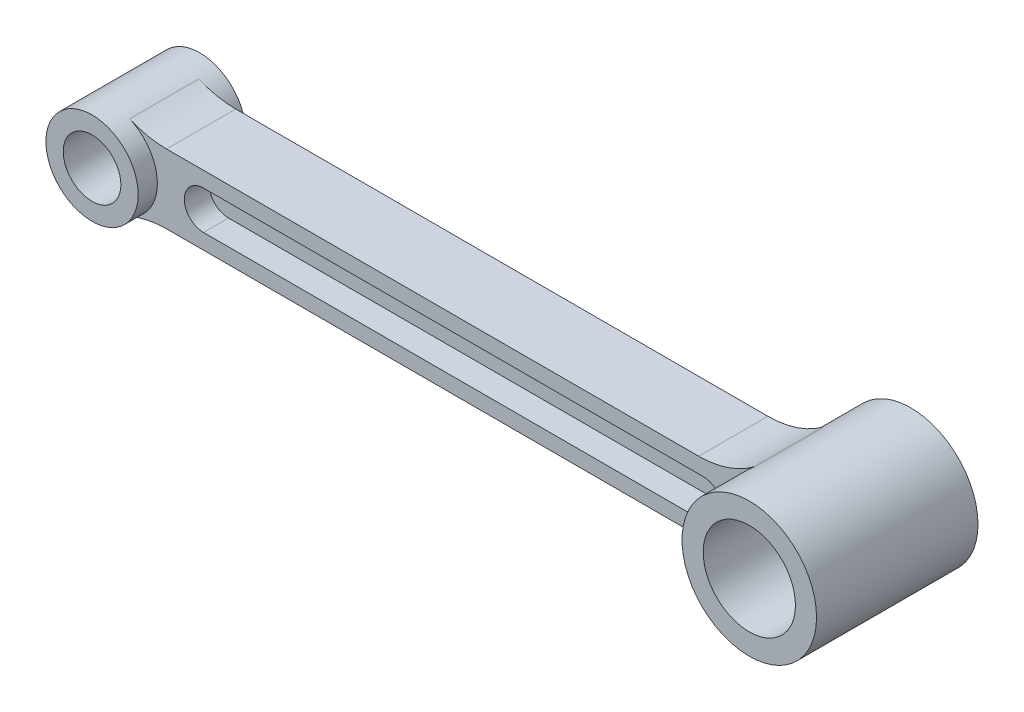
ISO-10303-21;
HEADER;
FILE_DESCRIPTION(('STEP AP214'),'2;1');
FILE_NAME('part.step','',(''),(''),'','','');
FILE_SCHEMA(('AUTOMOTIVE_DESIGN { 1 0 10303 214 1 1 1 1 }'));
ENDSEC;
DATA;
#1=APPLICATION_CONTEXT('core data for automotive mechanical design processes');
#2=APPLICATION_PROTOCOL_DEFINITION('international standard','automotive_design',2000,#1);
#3=PRODUCT_CONTEXT('',#1,'mechanical');
#4=PRODUCT('Part','Part','',(#3));
#5=PRODUCT_RELATED_PRODUCT_CATEGORY('part','',(#4));
#6=PRODUCT_DEFINITION_FORMATION('','',#4);
#7=PRODUCT_DEFINITION_CONTEXT('part definition',#1,'design');
#8=PRODUCT_DEFINITION('design','',#6,#7);
#9=PRODUCT_DEFINITION_SHAPE('','',#8);
#10=(LENGTH_UNIT() NAMED_UNIT(*) SI_UNIT(.MILLI.,.METRE.));
#11=(NAMED_UNIT(*) PLANE_ANGLE_UNIT() SI_UNIT($,.RADIAN.));
#12=(NAMED_UNIT(*) SI_UNIT($,.STERADIAN.) SOLID_ANGLE_UNIT());
#13=UNCERTAINTY_MEASURE_WITH_UNIT(LENGTH_MEASURE(1.E-05),#10,'distance_accuracy_value','');
#14=(GEOMETRIC_REPRESENTATION_CONTEXT(3) GLOBAL_UNCERTAINTY_ASSIGNED_CONTEXT((#13)) GLOBAL_UNIT_ASSIGNED_CONTEXT((#10,
#11,#12)) REPRESENTATION_CONTEXT('',''));
#15=CARTESIAN_POINT('',(0.,0.,0.));
#16=DIRECTION('',(0.,0.,1.));
#17=DIRECTION('',(1.,0.,0.));
#18=AXIS2_PLACEMENT_3D('',#15,#16,#17);
#19=CARTESIAN_POINT('',(-65.,0.,9.));
#20=DIRECTION('',(0.,0.,-1.));
#21=DIRECTION('',(-1.,0.,0.));
#22=AXIS2_PLACEMENT_3D('',#19,#20,#21);
#23=CYLINDRICAL_SURFACE('',#22,5.);
#24=DIRECTION('',(0.,0.,-1.));
#25=VECTOR('',#24,1.);
#26=CARTESIAN_POINT('',(-65.,4.99999999999998,9.));
#27=LINE('',#26,#25);
#28=CARTESIAN_POINT('',(-65.,4.99999999999998,-2.5));
#29=VERTEX_POINT('',#28);
#30=CARTESIAN_POINT('',(-65.,4.99999999999998,-9.));
#31=VERTEX_POINT('',#30);
#32=EDGE_CURVE('E190',#29,#31,#27,.T.);
#33=ORIENTED_EDGE('',*,*,#32,.F.);
#34=CARTESIAN_POINT('',(-65.,0.,-2.5));
#35=DIRECTION('',(0.,0.,1.));
#36=DIRECTION('',(1.,0.,0.));
#37=AXIS2_PLACEMENT_3D('',#34,#35,#36);
#38=CIRCLE('',#37,5.);
#39=CARTESIAN_POINT('',(-65.,-5.00000000000002,-2.5));
#40=VERTEX_POINT('',#39);
#41=EDGE_CURVE('E583',#29,#40,#38,.T.);
#42=ORIENTED_EDGE('',*,*,#41,.T.);
#43=DIRECTION('',(0.,0.,-1.));
#44=VECTOR('',#43,1.);
#45=CARTESIAN_POINT('',(-65.,-5.00000000000002,9.));
#46=LINE('',#45,#44);
#47=CARTESIAN_POINT('',(-65.,-5.00000000000002,-9.));
#48=VERTEX_POINT('',#47);
#49=EDGE_CURVE('E229',#40,#48,#46,.T.);
#50=ORIENTED_EDGE('',*,*,#49,.T.);
#51=CARTESIAN_POINT('',(-65.,0.,-9.));
#52=DIRECTION('',(0.,0.,1.));
#53=DIRECTION('',(1.,0.,0.));
#54=AXIS2_PLACEMENT_3D('',#51,#52,#53);
#55=CIRCLE('',#54,5.);
#56=EDGE_CURVE('E258',#31,#48,#55,.T.);
#57=ORIENTED_EDGE('',*,*,#56,.F.);
#58=EDGE_LOOP('',(#33,#42,#50,#57));
#59=FACE_BOUND('',#58,.T.);
#60=ADVANCED_FACE('F45',(#59),#23,.F.);
#61=CARTESIAN_POINT('',(0.,5.,9.));
#62=DIRECTION('',(0.,-1.,0.));
#63=DIRECTION('',(1.,0.,0.));
#64=AXIS2_PLACEMENT_3D('',#61,#62,#63);
#65=PLANE('',#64);
#66=DIRECTION('',(0.,0.,-1.));
#67=VECTOR('',#66,1.);
#68=CARTESIAN_POINT('',(65.,5.00000000000002,9.));
#69=LINE('',#68,#67);
#70=CARTESIAN_POINT('',(65.,5.00000000000002,-2.5));
#71=VERTEX_POINT('',#70);
#72=CARTESIAN_POINT('',(65.,5.00000000000002,-9.));
#73=VERTEX_POINT('',#72);
#74=EDGE_CURVE('E233',#71,#73,#69,.T.);
#75=ORIENTED_EDGE('',*,*,#74,.F.);
#76=DIRECTION('',(-1.,0.,0.));
#77=VECTOR('',#76,1.);
#78=CARTESIAN_POINT('',(0.,5.,-2.5));
#79=LINE('',#78,#77);
#80=EDGE_CURVE('E63',#71,#29,#79,.T.);
#81=ORIENTED_EDGE('',*,*,#80,.T.);
#82=ORIENTED_EDGE('',*,*,#32,.T.);
#83=DIRECTION('',(-1.,0.,0.));
#84=VECTOR('',#83,1.);
#85=CARTESIAN_POINT('',(0.,5.,-9.));
#86=LINE('',#85,#84);
#87=EDGE_CURVE('E265',#73,#31,#86,.T.);
#88=ORIENTED_EDGE('',*,*,#87,.F.);
#89=EDGE_LOOP('',(#75,#81,#82,#88));
#90=FACE_BOUND('',#89,.T.);
#91=ADVANCED_FACE('F404',(#90),#65,.T.);
#92=CARTESIAN_POINT('',(65.,0.,9.));
#93=DIRECTION('',(0.,0.,-1.));
#94=DIRECTION('',(-1.,0.,0.));
#95=AXIS2_PLACEMENT_3D('',#92,#93,#94);
#96=CYLINDRICAL_SURFACE('',#95,5.);
#97=DIRECTION('',(0.,0.,-1.));
#98=VECTOR('',#97,1.);
#99=CARTESIAN_POINT('',(65.,-4.99999999999998,9.));
#100=LINE('',#99,#98);
#101=CARTESIAN_POINT('',(65.,-4.99999999999998,-2.5));
#102=VERTEX_POINT('',#101);
#103=CARTESIAN_POINT('',(65.,-4.99999999999998,-9.));
#104=VERTEX_POINT('',#103);
#105=EDGE_CURVE('E228',#102,#104,#100,.T.);
#106=ORIENTED_EDGE('',*,*,#105,.F.);
#107=CARTESIAN_POINT('',(65.,0.,-2.5));
#108=DIRECTION('',(0.,0.,1.));
#109=DIRECTION('',(1.,0.,0.));
#110=AXIS2_PLACEMENT_3D('',#107,#108,#109);
#111=CIRCLE('',#110,5.);
#112=EDGE_CURVE('E71',#102,#71,#111,.T.);
#113=ORIENTED_EDGE('',*,*,#112,.T.);
#114=ORIENTED_EDGE('',*,*,#74,.T.);
#115=CARTESIAN_POINT('',(65.,0.,-9.));
#116=DIRECTION('',(0.,0.,1.));
#117=DIRECTION('',(1.,0.,0.));
#118=AXIS2_PLACEMENT_3D('',#115,#116,#117);
#119=CIRCLE('',#118,5.);
#120=EDGE_CURVE('E256',#104,#73,#119,.T.);
#121=ORIENTED_EDGE('',*,*,#120,.F.);
#122=EDGE_LOOP('',(#106,#113,#114,#121));
#123=FACE_BOUND('',#122,.T.);
#124=ADVANCED_FACE('F262',(#123),#96,.F.);
#125=CARTESIAN_POINT('',(0.,-5.,9.));
#126=DIRECTION('',(0.,-1.,0.));
#127=DIRECTION('',(1.,0.,0.));
#128=AXIS2_PLACEMENT_3D('',#125,#126,#127);
#129=PLANE('',#128);
#130=DIRECTION('',(-1.,0.,0.));
#131=VECTOR('',#130,1.);
#132=CARTESIAN_POINT('',(0.,-5.,-2.5));
#133=LINE('',#132,#131);
#134=EDGE_CURVE('E249',#102,#40,#133,.T.);
#135=ORIENTED_EDGE('',*,*,#134,.F.);
#136=ORIENTED_EDGE('',*,*,#105,.T.);
#137=DIRECTION('',(-1.,0.,0.));
#138=VECTOR('',#137,1.);
#139=CARTESIAN_POINT('',(0.,-5.,-9.));
#140=LINE('',#139,#138);
#141=EDGE_CURVE('E246',#104,#48,#140,.T.);
#142=ORIENTED_EDGE('',*,*,#141,.T.);
#143=ORIENTED_EDGE('',*,*,#49,.F.);
#144=EDGE_LOOP('',(#135,#136,#142,#143));
#145=FACE_BOUND('',#144,.T.);
#146=ADVANCED_FACE('F245',(#145),#129,.F.);
#147=CARTESIAN_POINT('',(-89.,0.,14.));
#148=DIRECTION('',(0.,0.,-1.));
#149=DIRECTION('',(-1.,0.,0.));
#150=AXIS2_PLACEMENT_3D('',#147,#148,#149);
#151=CYLINDRICAL_SURFACE('',#150,7.5);
#152=CARTESIAN_POINT('',(-89.,0.,14.));
#153=DIRECTION('',(0.,0.,1.));
#154=DIRECTION('',(1.,0.,0.));
#155=AXIS2_PLACEMENT_3D('',#152,#153,#154);
#156=CIRCLE('',#155,7.5);
#157=CARTESIAN_POINT('',(-81.5,0.,14.));
#158=VERTEX_POINT('',#157);
#159=EDGE_CURVE('E55',#158,#158,#156,.T.);
#160=ORIENTED_EDGE('',*,*,#159,.T.);
#161=EDGE_LOOP('',(#160));
#162=FACE_BOUND('',#161,.T.);
#163=CARTESIAN_POINT('',(-89.,0.,-14.));
#164=DIRECTION('',(0.,0.,1.));
#165=DIRECTION('',(1.,0.,0.));
#166=AXIS2_PLACEMENT_3D('',#163,#164,#165);
#167=CIRCLE('',#166,7.5);
#168=CARTESIAN_POINT('',(-81.5,0.,-14.));
#169=VERTEX_POINT('',#168);
#170=EDGE_CURVE('E203',#169,#169,#167,.T.);
#171=ORIENTED_EDGE('',*,*,#170,.F.);
#172=EDGE_LOOP('',(#171));
#173=FACE_BOUND('',#172,.T.);
#174=ADVANCED_FACE('F47',(#162,#173),#151,.F.);
#175=CARTESIAN_POINT('',(-89.,0.,14.));
#176=DIRECTION('',(0.,0.,-1.));
#177=DIRECTION('',(-1.,0.,0.));
#178=AXIS2_PLACEMENT_3D('',#175,#176,#177);
#179=CYLINDRICAL_SURFACE('',#178,12.);
#180=DIRECTION('',(0.,0.,-1.));
#181=VECTOR('',#180,1.);
#182=CARTESIAN_POINT('',(-84.2041684766873,-11.,9.));
#183=LINE('',#182,#181);
#184=CARTESIAN_POINT('',(-84.2041684766873,-11.,9.));
#185=VERTEX_POINT('',#184);
#186=CARTESIAN_POINT('',(-84.2041684766873,-11.,-9.));
#187=VERTEX_POINT('',#186);
#188=EDGE_CURVE('E205',#185,#187,#183,.T.);
#189=ORIENTED_EDGE('',*,*,#188,.F.);
#190=CARTESIAN_POINT('',(-89.,0.,9.));
#191=DIRECTION('',(0.,0.,1.));
#192=DIRECTION('',(1.,0.,0.));
#193=AXIS2_PLACEMENT_3D('',#190,#191,#192);
#194=CIRCLE('',#193,12.);
#195=CARTESIAN_POINT('',(-84.2041684766873,11.,9.));
#196=VERTEX_POINT('',#195);
#197=EDGE_CURVE('E380',#185,#196,#194,.T.);
#198=ORIENTED_EDGE('',*,*,#197,.T.);
#199=DIRECTION('',(0.,0.,-1.));
#200=VECTOR('',#199,1.);
#201=CARTESIAN_POINT('',(-84.2041684766873,11.,9.));
#202=LINE('',#201,#200);
#203=CARTESIAN_POINT('',(-84.2041684766873,11.,-9.));
#204=VERTEX_POINT('',#203);
#205=EDGE_CURVE('E189',#196,#204,#202,.T.);
#206=ORIENTED_EDGE('',*,*,#205,.T.);
#207=CARTESIAN_POINT('',(-89.,0.,-9.));
#208=DIRECTION('',(0.,0.,1.));
#209=DIRECTION('',(1.,0.,0.));
#210=AXIS2_PLACEMENT_3D('',#207,#208,#209);
#211=CIRCLE('',#210,12.);
#212=EDGE_CURVE('E260',#187,#204,#211,.T.);
#213=ORIENTED_EDGE('',*,*,#212,.F.);
#214=EDGE_LOOP('',(#189,#198,#206,#213));
#215=FACE_BOUND('',#214,.T.);
#216=CARTESIAN_POINT('',(-89.,0.,14.));
#217=DIRECTION('',(0.,0.,1.));
#218=DIRECTION('',(1.,0.,0.));
#219=AXIS2_PLACEMENT_3D('',#216,#217,#218);
#220=CIRCLE('',#219,12.);
#221=CARTESIAN_POINT('',(-77.,0.,14.));
#222=VERTEX_POINT('',#221);
#223=EDGE_CURVE('E11',#222,#222,#220,.T.);
#224=ORIENTED_EDGE('',*,*,#223,.F.);
#225=EDGE_LOOP('',(#224));
#226=FACE_BOUND('',#225,.T.);
#227=CARTESIAN_POINT('',(-89.,0.,-14.));
#228=DIRECTION('',(0.,0.,1.));
#229=DIRECTION('',(1.,0.,0.));
#230=AXIS2_PLACEMENT_3D('',#227,#228,#229);
#231=CIRCLE('',#230,12.);
#232=CARTESIAN_POINT('',(-77.,0.,-14.));
#233=VERTEX_POINT('',#232);
#234=EDGE_CURVE('E49',#233,#233,#231,.T.);
#235=ORIENTED_EDGE('',*,*,#234,.T.);
#236=EDGE_LOOP('',(#235));
#237=FACE_BOUND('',#236,.T.);
#238=ADVANCED_FACE('F640',(#215,#226,#237),#179,.T.);
#239=CARTESIAN_POINT('',(0.,0.,14.));
#240=DIRECTION('',(0.,0.,1.));
#241=DIRECTION('',(1.,0.,0.));
#242=AXIS2_PLACEMENT_3D('',#239,#240,#241);
#243=PLANE('',#242);
#244=ORIENTED_EDGE('',*,*,#159,.F.);
#245=EDGE_LOOP('',(#244));
#246=FACE_BOUND('',#245,.T.);
#247=ORIENTED_EDGE('',*,*,#223,.T.);
#248=EDGE_LOOP('',(#247));
#249=FACE_BOUND('',#248,.T.);
#250=ADVANCED_FACE('F400',(#246,#249),#243,.T.);
#251=CARTESIAN_POINT('',(0.,0.,-14.));
#252=DIRECTION('',(0.,0.,1.));
#253=DIRECTION('',(1.,0.,0.));
#254=AXIS2_PLACEMENT_3D('',#251,#252,#253);
#255=PLANE('',#254);
#256=ORIENTED_EDGE('',*,*,#170,.T.);
#257=EDGE_LOOP('',(#256));
#258=FACE_BOUND('',#257,.T.);
#259=ORIENTED_EDGE('',*,*,#234,.F.);
#260=EDGE_LOOP('',(#259));
#261=FACE_BOUND('',#260,.T.);
#262=ADVANCED_FACE('F394',(#258,#261),#255,.F.);
#263=CARTESIAN_POINT('',(-74.6125054300619,-33.,9.));
#264=DIRECTION('',(0.,0.,-1.));
#265=DIRECTION('',(-1.,0.,0.));
#266=AXIS2_PLACEMENT_3D('',#263,#264,#265);
#267=CYLINDRICAL_SURFACE('',#266,24.);
#268=CARTESIAN_POINT('',(-74.6125054300619,-33.,-9.));
#269=DIRECTION('',(0.,0.,1.));
#270=DIRECTION('',(1.,0.,0.));
#271=AXIS2_PLACEMENT_3D('',#268,#269,#270);
#272=CIRCLE('',#271,24.);
#273=CARTESIAN_POINT('',(-74.6125054300619,-9.00000000000002,-9.));
#274=VERTEX_POINT('',#273);
#275=EDGE_CURVE('E275',#187,#274,#272,.F.);
#276=ORIENTED_EDGE('',*,*,#275,.T.);
#277=DIRECTION('',(0.,0.,-1.));
#278=VECTOR('',#277,1.);
#279=CARTESIAN_POINT('',(-74.6125054300619,-9.00000000000002,9.));
#280=LINE('',#279,#278);
#281=CARTESIAN_POINT('',(-74.6125054300619,-9.00000000000002,9.));
#282=VERTEX_POINT('',#281);
#283=EDGE_CURVE('E213',#282,#274,#280,.T.);
#284=ORIENTED_EDGE('',*,*,#283,.F.);
#285=CARTESIAN_POINT('',(-74.6125054300619,-33.,9.));
#286=DIRECTION('',(0.,0.,1.));
#287=DIRECTION('',(1.,0.,0.));
#288=AXIS2_PLACEMENT_3D('',#285,#286,#287);
#289=CIRCLE('',#288,24.);
#290=EDGE_CURVE('E383',#185,#282,#289,.F.);
#291=ORIENTED_EDGE('',*,*,#290,.F.);
#292=ORIENTED_EDGE('',*,*,#188,.T.);
#293=EDGE_LOOP('',(#276,#284,#291,#292));
#294=FACE_BOUND('',#293,.T.);
#295=ADVANCED_FACE('F392',(#294),#267,.F.);
#296=CARTESIAN_POINT('',(0.,-9.,9.));
#297=DIRECTION('',(0.,1.,0.));
#298=DIRECTION('',(-1.,0.,0.));
#299=AXIS2_PLACEMENT_3D('',#296,#297,#298);
#300=PLANE('',#299);
#301=DIRECTION('',(1.,0.,0.));
#302=VECTOR('',#301,1.);
#303=CARTESIAN_POINT('',(0.,-9.,-9.));
#304=LINE('',#303,#302);
#305=CARTESIAN_POINT('',(63.8355409356768,-8.99999999999999,-9.));
#306=VERTEX_POINT('',#305);
#307=EDGE_CURVE('E278',#274,#306,#304,.T.);
#308=ORIENTED_EDGE('',*,*,#307,.T.);
#309=DIRECTION('',(0.,0.,-1.));
#310=VECTOR('',#309,1.);
#311=CARTESIAN_POINT('',(63.8355409356768,-8.99999999999999,9.));
#312=LINE('',#311,#310);
#313=CARTESIAN_POINT('',(63.8355409356768,-8.99999999999999,9.));
#314=VERTEX_POINT('',#313);
#315=EDGE_CURVE('E223',#314,#306,#312,.T.);
#316=ORIENTED_EDGE('',*,*,#315,.F.);
#317=DIRECTION('',(1.,0.,0.));
#318=VECTOR('',#317,1.);
#319=CARTESIAN_POINT('',(0.,-9.,9.));
#320=LINE('',#319,#318);
#321=EDGE_CURVE('E386',#282,#314,#320,.T.);
#322=ORIENTED_EDGE('',*,*,#321,.F.);
#323=ORIENTED_EDGE('',*,*,#283,.T.);
#324=EDGE_LOOP('',(#308,#316,#322,#323));
#325=FACE_BOUND('',#324,.T.);
#326=ADVANCED_FACE('F322',(#325),#300,.F.);
#327=CARTESIAN_POINT('',(63.8355409356768,-33.,9.));
#328=DIRECTION('',(0.,0.,-1.));
#329=DIRECTION('',(-1.,0.,0.));
#330=AXIS2_PLACEMENT_3D('',#327,#328,#329);
#331=CYLINDRICAL_SURFACE('',#330,24.);
#332=CARTESIAN_POINT('',(63.8355409356768,-33.,-9.));
#333=DIRECTION('',(0.,0.,1.));
#334=DIRECTION('',(1.,0.,0.));
#335=AXIS2_PLACEMENT_3D('',#332,#333,#334);
#336=CIRCLE('',#335,24.);
#337=CARTESIAN_POINT('',(78.3884811174541,-13.9156626506024,-9.));
#338=VERTEX_POINT('',#337);
#339=EDGE_CURVE('E282',#306,#338,#336,.F.);
#340=ORIENTED_EDGE('',*,*,#339,.T.);
#341=DIRECTION('',(0.,0.,-1.));
#342=VECTOR('',#341,1.);
#343=CARTESIAN_POINT('',(78.3884811174541,-13.9156626506024,9.));
#344=LINE('',#343,#342);
#345=CARTESIAN_POINT('',(78.3884811174541,-13.9156626506024,9.));
#346=VERTEX_POINT('',#345);
#347=EDGE_CURVE('E310',#346,#338,#344,.T.);
#348=ORIENTED_EDGE('',*,*,#347,.F.);
#349=CARTESIAN_POINT('',(63.8355409356768,-33.,9.));
#350=DIRECTION('',(0.,0.,1.));
#351=DIRECTION('',(1.,0.,0.));
#352=AXIS2_PLACEMENT_3D('',#349,#350,#351);
#353=CIRCLE('',#352,24.);
#354=EDGE_CURVE('E319',#314,#346,#353,.F.);
#355=ORIENTED_EDGE('',*,*,#354,.F.);
#356=ORIENTED_EDGE('',*,*,#315,.T.);
#357=EDGE_LOOP('',(#340,#348,#355,#356));
#358=FACE_BOUND('',#357,.T.);
#359=ADVANCED_FACE('F316',(#358),#331,.F.);
#360=CARTESIAN_POINT('',(63.8355409356768,33.,9.));
#361=DIRECTION('',(0.,0.,-1.));
#362=DIRECTION('',(-1.,0.,0.));
#363=AXIS2_PLACEMENT_3D('',#360,#361,#362);
#364=CYLINDRICAL_SURFACE('',#363,24.);
#365=CARTESIAN_POINT('',(63.8355409356768,33.,-9.));
#366=DIRECTION('',(0.,0.,1.));
#367=DIRECTION('',(1.,0.,0.));
#368=AXIS2_PLACEMENT_3D('',#365,#366,#367);
#369=CIRCLE('',#368,24.);
#370=CARTESIAN_POINT('',(63.8355409356768,8.99999999999998,-9.));
#371=VERTEX_POINT('',#370);
#372=CARTESIAN_POINT('',(78.3884811174541,13.9156626506024,-9.));
#373=VERTEX_POINT('',#372);
#374=EDGE_CURVE('E289',#371,#373,#369,.T.);
#375=ORIENTED_EDGE('',*,*,#374,.F.);
#376=DIRECTION('',(0.,0.,-1.));
#377=VECTOR('',#376,1.);
#378=CARTESIAN_POINT('',(63.8355409356768,8.99999999999998,9.));
#379=LINE('',#378,#377);
#380=CARTESIAN_POINT('',(63.8355409356768,8.99999999999998,9.));
#381=VERTEX_POINT('',#380);
#382=EDGE_CURVE('E303',#381,#371,#379,.T.);
#383=ORIENTED_EDGE('',*,*,#382,.F.);
#384=CARTESIAN_POINT('',(63.8355409356768,33.,9.));
#385=DIRECTION('',(0.,0.,1.));
#386=DIRECTION('',(1.,0.,0.));
#387=AXIS2_PLACEMENT_3D('',#384,#385,#386);
#388=CIRCLE('',#387,24.);
#389=CARTESIAN_POINT('',(78.3884811174541,13.9156626506024,9.));
#390=VERTEX_POINT('',#389);
#391=EDGE_CURVE('E333',#381,#390,#388,.T.);
#392=ORIENTED_EDGE('',*,*,#391,.T.);
#393=DIRECTION('',(0.,0.,-1.));
#394=VECTOR('',#393,1.);
#395=CARTESIAN_POINT('',(78.3884811174541,13.9156626506024,9.));
#396=LINE('',#395,#394);
#397=EDGE_CURVE('E306',#390,#373,#396,.T.);
#398=ORIENTED_EDGE('',*,*,#397,.T.);
#399=EDGE_LOOP('',(#375,#383,#392,#398));
#400=FACE_BOUND('',#399,.T.);
#401=ADVANCED_FACE('F331',(#400),#364,.F.);
#402=CARTESIAN_POINT('',(0.,8.99999999999998,9.));
#403=DIRECTION('',(0.,1.,0.));
#404=DIRECTION('',(-1.,0.,0.));
#405=AXIS2_PLACEMENT_3D('',#402,#403,#404);
#406=PLANE('',#405);
#407=DIRECTION('',(1.,0.,0.));
#408=VECTOR('',#407,1.);
#409=CARTESIAN_POINT('',(0.,8.99999999999998,-9.));
#410=LINE('',#409,#408);
#411=CARTESIAN_POINT('',(-74.6125054300619,8.99999999999999,-9.));
#412=VERTEX_POINT('',#411);
#413=EDGE_CURVE('E293',#412,#371,#410,.T.);
#414=ORIENTED_EDGE('',*,*,#413,.F.);
#415=DIRECTION('',(0.,0.,-1.));
#416=VECTOR('',#415,1.);
#417=CARTESIAN_POINT('',(-74.6125054300619,8.99999999999999,9.));
#418=LINE('',#417,#416);
#419=CARTESIAN_POINT('',(-74.6125054300619,8.99999999999999,9.));
#420=VERTEX_POINT('',#419);
#421=EDGE_CURVE('E195',#420,#412,#418,.T.);
#422=ORIENTED_EDGE('',*,*,#421,.F.);
#423=DIRECTION('',(1.,0.,0.));
#424=VECTOR('',#423,1.);
#425=CARTESIAN_POINT('',(0.,8.99999999999998,9.));
#426=LINE('',#425,#424);
#427=EDGE_CURVE('E338',#420,#381,#426,.T.);
#428=ORIENTED_EDGE('',*,*,#427,.T.);
#429=ORIENTED_EDGE('',*,*,#382,.T.);
#430=EDGE_LOOP('',(#414,#422,#428,#429));
#431=FACE_BOUND('',#430,.T.);
#432=ADVANCED_FACE('F412',(#431),#406,.T.);
#433=CARTESIAN_POINT('',(-65.,0.,2.5));
#434=DIRECTION('',(0.,0.,1.));
#435=DIRECTION('',(1.,0.,0.));
#436=AXIS2_PLACEMENT_3D('',#433,#434,#435);
#437=CIRCLE('',#436,5.);
#438=CARTESIAN_POINT('',(-65.,4.99999999999998,2.5));
#439=VERTEX_POINT('',#438);
#440=CARTESIAN_POINT('',(-65.,-5.00000000000002,2.5));
#441=VERTEX_POINT('',#440);
#442=EDGE_CURVE('E164',#439,#441,#437,.T.);
#443=ORIENTED_EDGE('',*,*,#442,.F.);
#444=CARTESIAN_POINT('',(-65.,4.99999999999998,9.));
#445=VERTEX_POINT('',#444);
#446=EDGE_CURVE('E177',#445,#439,#27,.T.);
#447=ORIENTED_EDGE('',*,*,#446,.F.);
#448=CARTESIAN_POINT('',(-65.,0.,9.));
#449=DIRECTION('',(0.,0.,1.));
#450=DIRECTION('',(1.,0.,0.));
#451=AXIS2_PLACEMENT_3D('',#448,#449,#450);
#452=CIRCLE('',#451,5.);
#453=CARTESIAN_POINT('',(-65.,-5.00000000000002,9.));
#454=VERTEX_POINT('',#453);
#455=EDGE_CURVE('E299',#445,#454,#452,.T.);
#456=ORIENTED_EDGE('',*,*,#455,.T.);
#457=EDGE_CURVE('E180',#454,#441,#46,.T.);
#458=ORIENTED_EDGE('',*,*,#457,.T.);
#459=EDGE_LOOP('',(#443,#447,#456,#458));
#460=FACE_BOUND('',#459,.T.);
#461=ADVANCED_FACE('F175',(#460),#23,.F.);
#462=DIRECTION('',(-1.,0.,0.));
#463=VECTOR('',#462,1.);
#464=CARTESIAN_POINT('',(0.,5.,2.5));
#465=LINE('',#464,#463);
#466=CARTESIAN_POINT('',(65.,5.00000000000002,2.5));
#467=VERTEX_POINT('',#466);
#468=EDGE_CURVE('E161',#467,#439,#465,.T.);
#469=ORIENTED_EDGE('',*,*,#468,.F.);
#470=CARTESIAN_POINT('',(65.,5.00000000000002,9.));
#471=VERTEX_POINT('',#470);
#472=EDGE_CURVE('E197',#471,#467,#69,.T.);
#473=ORIENTED_EDGE('',*,*,#472,.F.);
#474=DIRECTION('',(-1.,0.,0.));
#475=VECTOR('',#474,1.);
#476=CARTESIAN_POINT('',(0.,5.,9.));
#477=LINE('',#476,#475);
#478=EDGE_CURVE('E187',#471,#445,#477,.T.);
#479=ORIENTED_EDGE('',*,*,#478,.T.);
#480=ORIENTED_EDGE('',*,*,#446,.T.);
#481=EDGE_LOOP('',(#469,#473,#479,#480));
#482=FACE_BOUND('',#481,.T.);
#483=ADVANCED_FACE('F185',(#482),#65,.T.);
#484=CARTESIAN_POINT('',(65.,0.,2.5));
#485=DIRECTION('',(0.,0.,1.));
#486=DIRECTION('',(1.,0.,0.));
#487=AXIS2_PLACEMENT_3D('',#484,#485,#486);
#488=CIRCLE('',#487,5.);
#489=CARTESIAN_POINT('',(65.,-4.99999999999998,2.5));
#490=VERTEX_POINT('',#489);
#491=EDGE_CURVE('E167',#490,#467,#488,.T.);
#492=ORIENTED_EDGE('',*,*,#491,.F.);
#493=CARTESIAN_POINT('',(65.,-4.99999999999998,9.));
#494=VERTEX_POINT('',#493);
#495=EDGE_CURVE('E230',#494,#490,#100,.T.);
#496=ORIENTED_EDGE('',*,*,#495,.F.);
#497=CARTESIAN_POINT('',(65.,0.,9.));
#498=DIRECTION('',(0.,0.,1.));
#499=DIRECTION('',(1.,0.,0.));
#500=AXIS2_PLACEMENT_3D('',#497,#498,#499);
#501=CIRCLE('',#500,5.);
#502=EDGE_CURVE('E373',#494,#471,#501,.T.);
#503=ORIENTED_EDGE('',*,*,#502,.T.);
#504=ORIENTED_EDGE('',*,*,#472,.T.);
#505=EDGE_LOOP('',(#492,#496,#503,#504));
#506=FACE_BOUND('',#505,.T.);
#507=ADVANCED_FACE('F416',(#506),#96,.F.);
#508=ORIENTED_EDGE('',*,*,#495,.T.);
#509=DIRECTION('',(-1.,0.,0.));
#510=VECTOR('',#509,1.);
#511=CARTESIAN_POINT('',(0.,-5.,2.5));
#512=LINE('',#511,#510);
#513=EDGE_CURVE('E182',#490,#441,#512,.T.);
#514=ORIENTED_EDGE('',*,*,#513,.T.);
#515=ORIENTED_EDGE('',*,*,#457,.F.);
#516=DIRECTION('',(-1.,0.,0.));
#517=VECTOR('',#516,1.);
#518=CARTESIAN_POINT('',(0.,-5.,9.));
#519=LINE('',#518,#517);
#520=EDGE_CURVE('E377',#494,#454,#519,.T.);
#521=ORIENTED_EDGE('',*,*,#520,.F.);
#522=EDGE_LOOP('',(#508,#514,#515,#521));
#523=FACE_BOUND('',#522,.T.);
#524=ADVANCED_FACE('F449',(#523),#129,.F.);
#525=CARTESIAN_POINT('',(-74.6125054300619,33.,9.));
#526=DIRECTION('',(0.,0.,-1.));
#527=DIRECTION('',(-1.,0.,0.));
#528=AXIS2_PLACEMENT_3D('',#525,#526,#527);
#529=CYLINDRICAL_SURFACE('',#528,24.);
#530=CARTESIAN_POINT('',(-74.6125054300619,33.,-9.));
#531=DIRECTION('',(0.,0.,1.));
#532=DIRECTION('',(1.,0.,0.));
#533=AXIS2_PLACEMENT_3D('',#530,#531,#532);
#534=CIRCLE('',#533,24.);
#535=EDGE_CURVE('E296',#204,#412,#534,.T.);
#536=ORIENTED_EDGE('',*,*,#535,.F.);
#537=ORIENTED_EDGE('',*,*,#205,.F.);
#538=CARTESIAN_POINT('',(-74.6125054300619,33.,9.));
#539=DIRECTION('',(0.,0.,1.));
#540=DIRECTION('',(1.,0.,0.));
#541=AXIS2_PLACEMENT_3D('',#538,#539,#540);
#542=CIRCLE('',#541,24.);
#543=EDGE_CURVE('E343',#196,#420,#542,.T.);
#544=ORIENTED_EDGE('',*,*,#543,.T.);
#545=ORIENTED_EDGE('',*,*,#421,.T.);
#546=EDGE_LOOP('',(#536,#537,#544,#545));
#547=FACE_BOUND('',#546,.T.);
#548=ADVANCED_FACE('F424',(#547),#529,.F.);
#549=CARTESIAN_POINT('',(0.,0.,9.));
#550=DIRECTION('',(0.,0.,1.));
#551=DIRECTION('',(1.,0.,0.));
#552=AXIS2_PLACEMENT_3D('',#549,#550,#551);
#553=PLANE('',#552);
#554=ORIENTED_EDGE('',*,*,#455,.F.);
#555=ORIENTED_EDGE('',*,*,#478,.F.);
#556=ORIENTED_EDGE('',*,*,#502,.F.);
#557=ORIENTED_EDGE('',*,*,#520,.T.);
#558=EDGE_LOOP('',(#554,#555,#556,#557));
#559=FACE_BOUND('',#558,.T.);
#560=ORIENTED_EDGE('',*,*,#197,.F.);
#561=ORIENTED_EDGE('',*,*,#290,.T.);
#562=ORIENTED_EDGE('',*,*,#321,.T.);
#563=ORIENTED_EDGE('',*,*,#354,.T.);
#564=CARTESIAN_POINT('',(89.,0.,9.));
#565=DIRECTION('',(0.,0.,1.));
#566=DIRECTION('',(1.,0.,0.));
#567=AXIS2_PLACEMENT_3D('',#564,#565,#566);
#568=CIRCLE('',#567,17.5);
#569=EDGE_CURVE('E339',#390,#346,#568,.T.);
#570=ORIENTED_EDGE('',*,*,#569,.F.);
#571=ORIENTED_EDGE('',*,*,#391,.F.);
#572=ORIENTED_EDGE('',*,*,#427,.F.);
#573=ORIENTED_EDGE('',*,*,#543,.F.);
#574=EDGE_LOOP('',(#560,#561,#562,#563,#570,#571,#572,#573));
#575=FACE_BOUND('',#574,.T.);
#576=ADVANCED_FACE('F390',(#559,#575),#553,.T.);
#577=CARTESIAN_POINT('',(0.,0.,-9.));
#578=DIRECTION('',(0.,0.,1.));
#579=DIRECTION('',(1.,0.,0.));
#580=AXIS2_PLACEMENT_3D('',#577,#578,#579);
#581=PLANE('',#580);
#582=ORIENTED_EDGE('',*,*,#56,.T.);
#583=ORIENTED_EDGE('',*,*,#141,.F.);
#584=ORIENTED_EDGE('',*,*,#120,.T.);
#585=ORIENTED_EDGE('',*,*,#87,.T.);
#586=EDGE_LOOP('',(#582,#583,#584,#585));
#587=FACE_BOUND('',#586,.T.);
#588=ORIENTED_EDGE('',*,*,#212,.T.);
#589=ORIENTED_EDGE('',*,*,#535,.T.);
#590=ORIENTED_EDGE('',*,*,#413,.T.);
#591=ORIENTED_EDGE('',*,*,#374,.T.);
#592=CARTESIAN_POINT('',(89.,0.,-9.));
#593=DIRECTION('',(0.,0.,1.));
#594=DIRECTION('',(1.,0.,0.));
#595=AXIS2_PLACEMENT_3D('',#592,#593,#594);
#596=CIRCLE('',#595,17.5);
#597=EDGE_CURVE('E285',#373,#338,#596,.T.);
#598=ORIENTED_EDGE('',*,*,#597,.T.);
#599=ORIENTED_EDGE('',*,*,#339,.F.);
#600=ORIENTED_EDGE('',*,*,#307,.F.);
#601=ORIENTED_EDGE('',*,*,#275,.F.);
#602=EDGE_LOOP('',(#588,#589,#590,#591,#598,#599,#600,#601));
#603=FACE_BOUND('',#602,.T.);
#604=ADVANCED_FACE('F253',(#587,#603),#581,.F.);
#605=CARTESIAN_POINT('',(89.,0.,21.));
#606=DIRECTION('',(0.,0.,-1.));
#607=DIRECTION('',(-1.,0.,0.));
#608=AXIS2_PLACEMENT_3D('',#605,#606,#607);
#609=CYLINDRICAL_SURFACE('',#608,12.);
#610=CARTESIAN_POINT('',(89.,0.,21.));
#611=DIRECTION('',(0.,0.,1.));
#612=DIRECTION('',(1.,0.,0.));
#613=AXIS2_PLACEMENT_3D('',#610,#611,#612);
#614=CIRCLE('',#613,12.);
#615=CARTESIAN_POINT('',(101.,0.,21.));
#616=VERTEX_POINT('',#615);
#617=EDGE_CURVE('E354',#616,#616,#614,.T.);
#618=ORIENTED_EDGE('',*,*,#617,.T.);
#619=EDGE_LOOP('',(#618));
#620=FACE_BOUND('',#619,.T.);
#621=CARTESIAN_POINT('',(89.,0.,-21.));
#622=DIRECTION('',(0.,0.,1.));
#623=DIRECTION('',(1.,0.,0.));
#624=AXIS2_PLACEMENT_3D('',#621,#622,#623);
#625=CIRCLE('',#624,12.);
#626=CARTESIAN_POINT('',(101.,0.,-21.));
#627=VERTEX_POINT('',#626);
#628=EDGE_CURVE('E364',#627,#627,#625,.T.);
#629=ORIENTED_EDGE('',*,*,#628,.F.);
#630=EDGE_LOOP('',(#629));
#631=FACE_BOUND('',#630,.T.);
#632=ADVANCED_FACE('F469',(#620,#631),#609,.F.);
#633=CARTESIAN_POINT('',(89.,0.,21.));
#634=DIRECTION('',(0.,0.,-1.));
#635=DIRECTION('',(-1.,0.,0.));
#636=AXIS2_PLACEMENT_3D('',#633,#634,#635);
#637=CYLINDRICAL_SURFACE('',#636,17.5);
#638=ORIENTED_EDGE('',*,*,#569,.T.);
#639=ORIENTED_EDGE('',*,*,#347,.T.);
#640=ORIENTED_EDGE('',*,*,#597,.F.);
#641=ORIENTED_EDGE('',*,*,#397,.F.);
#642=EDGE_LOOP('',(#638,#639,#640,#641));
#643=FACE_BOUND('',#642,.T.);
#644=CARTESIAN_POINT('',(89.,0.,21.));
#645=DIRECTION('',(0.,0.,1.));
#646=DIRECTION('',(1.,0.,0.));
#647=AXIS2_PLACEMENT_3D('',#644,#645,#646);
#648=CIRCLE('',#647,17.5);
#649=CARTESIAN_POINT('',(106.5,0.,21.));
#650=VERTEX_POINT('',#649);
#651=EDGE_CURVE('E351',#650,#650,#648,.T.);
#652=ORIENTED_EDGE('',*,*,#651,.F.);
#653=EDGE_LOOP('',(#652));
#654=FACE_BOUND('',#653,.T.);
#655=CARTESIAN_POINT('',(89.,0.,-21.));
#656=DIRECTION('',(0.,0.,1.));
#657=DIRECTION('',(1.,0.,0.));
#658=AXIS2_PLACEMENT_3D('',#655,#656,#657);
#659=CIRCLE('',#658,17.5);
#660=CARTESIAN_POINT('',(106.5,0.,-21.));
#661=VERTEX_POINT('',#660);
#662=EDGE_CURVE('E360',#661,#661,#659,.T.);
#663=ORIENTED_EDGE('',*,*,#662,.T.);
#664=EDGE_LOOP('',(#663));
#665=FACE_BOUND('',#664,.T.);
#666=ADVANCED_FACE('F326',(#643,#654,#665),#637,.T.);
#667=CARTESIAN_POINT('',(0.,0.,21.));
#668=DIRECTION('',(0.,0.,1.));
#669=DIRECTION('',(1.,0.,0.));
#670=AXIS2_PLACEMENT_3D('',#667,#668,#669);
#671=PLANE('',#670);
#672=ORIENTED_EDGE('',*,*,#617,.F.);
#673=EDGE_LOOP('',(#672));
#674=FACE_BOUND('',#673,.T.);
#675=ORIENTED_EDGE('',*,*,#651,.T.);
#676=EDGE_LOOP('',(#675));
#677=FACE_BOUND('',#676,.T.);
#678=ADVANCED_FACE('F487',(#674,#677),#671,.T.);
#679=CARTESIAN_POINT('',(0.,0.,-21.));
#680=DIRECTION('',(0.,0.,1.));
#681=DIRECTION('',(1.,0.,0.));
#682=AXIS2_PLACEMENT_3D('',#679,#680,#681);
#683=PLANE('',#682);
#684=ORIENTED_EDGE('',*,*,#628,.T.);
#685=EDGE_LOOP('',(#684));
#686=FACE_BOUND('',#685,.T.);
#687=ORIENTED_EDGE('',*,*,#662,.F.);
#688=EDGE_LOOP('',(#687));
#689=FACE_BOUND('',#688,.T.);
#690=ADVANCED_FACE('F495',(#686,#689),#683,.F.);
#691=CARTESIAN_POINT('',(0.,0.,-2.5));
#692=DIRECTION('',(0.,0.,1.));
#693=DIRECTION('',(1.,0.,0.));
#694=AXIS2_PLACEMENT_3D('',#691,#692,#693);
#695=PLANE('',#694);
#696=ORIENTED_EDGE('',*,*,#80,.F.);
#697=ORIENTED_EDGE('',*,*,#112,.F.);
#698=ORIENTED_EDGE('',*,*,#134,.T.);
#699=ORIENTED_EDGE('',*,*,#41,.F.);
#700=EDGE_LOOP('',(#696,#697,#698,#699));
#701=FACE_BOUND('',#700,.T.);
#702=ADVANCED_FACE('F503',(#701),#695,.F.);
#703=CARTESIAN_POINT('',(0.,0.,2.5));
#704=DIRECTION('',(0.,0.,1.));
#705=DIRECTION('',(1.,0.,0.));
#706=AXIS2_PLACEMENT_3D('',#703,#704,#705);
#707=PLANE('',#706);
#708=ORIENTED_EDGE('',*,*,#468,.T.);
#709=ORIENTED_EDGE('',*,*,#442,.T.);
#710=ORIENTED_EDGE('',*,*,#513,.F.);
#711=ORIENTED_EDGE('',*,*,#491,.T.);
#712=EDGE_LOOP('',(#708,#709,#710,#711));
#713=FACE_BOUND('',#712,.T.);
#714=ADVANCED_FACE('F163',(#713),#707,.T.);
#715=CLOSED_SHELL('',(#60,#91,#124,#146,#174,#238,#250,#262,#295,#326,#359,#401,#432,#461,#483,
#507,#524,#548,#576,#604,#632,#666,#678,#690,#702,#714));
#716=MANIFOLD_SOLID_BREP('B2',#715);
#717=ADVANCED_BREP_SHAPE_REPRESENTATION('',(#18,#716),#14);
#718=SHAPE_DEFINITION_REPRESENTATION(#9,#717);
ENDSEC;
END-ISO-10303-21;
